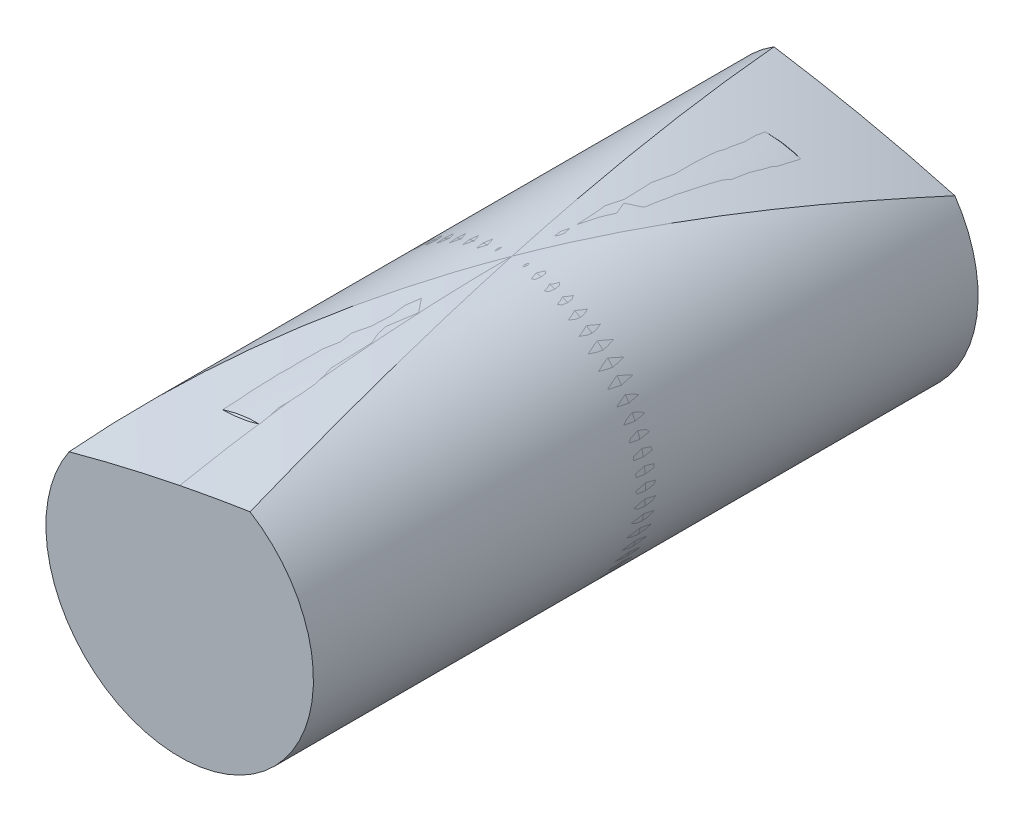
ISO-10303-21;
HEADER;
FILE_DESCRIPTION(('STEP AP214'),'2;1');
FILE_NAME('part.step','',(''),(''),'','','');
FILE_SCHEMA(('AUTOMOTIVE_DESIGN { 1 0 10303 214 1 1 1 1 }'));
ENDSEC;
DATA;
#1=APPLICATION_CONTEXT('core data for automotive mechanical design processes');
#2=APPLICATION_PROTOCOL_DEFINITION('international standard','automotive_design',2000,#1);
#3=PRODUCT_CONTEXT('',#1,'mechanical');
#4=PRODUCT('Part','Part','',(#3));
#5=PRODUCT_RELATED_PRODUCT_CATEGORY('part','',(#4));
#6=PRODUCT_DEFINITION_FORMATION('','',#4);
#7=PRODUCT_DEFINITION_CONTEXT('part definition',#1,'design');
#8=PRODUCT_DEFINITION('design','',#6,#7);
#9=PRODUCT_DEFINITION_SHAPE('','',#8);
#10=(LENGTH_UNIT() NAMED_UNIT(*) SI_UNIT(.MILLI.,.METRE.));
#11=(NAMED_UNIT(*) PLANE_ANGLE_UNIT() SI_UNIT($,.RADIAN.));
#12=(NAMED_UNIT(*) SI_UNIT($,.STERADIAN.) SOLID_ANGLE_UNIT());
#13=UNCERTAINTY_MEASURE_WITH_UNIT(LENGTH_MEASURE(1.E-05),#10,'distance_accuracy_value','');
#14=(GEOMETRIC_REPRESENTATION_CONTEXT(3) GLOBAL_UNCERTAINTY_ASSIGNED_CONTEXT((#13)) GLOBAL_UNIT_ASSIGNED_CONTEXT((#10,
#11,#12)) REPRESENTATION_CONTEXT('',''));
#15=CARTESIAN_POINT('',(0.,0.,0.));
#16=DIRECTION('',(0.,0.,1.));
#17=DIRECTION('',(1.,0.,0.));
#18=AXIS2_PLACEMENT_3D('',#15,#16,#17);
#19=CARTESIAN_POINT('',(0.,-101.5,0.));
#20=DIRECTION('',(-1.,0.,0.));
#21=DIRECTION('',(0.,0.,-1.));
#22=AXIS2_PLACEMENT_3D('',#19,#20,#21);
#23=ELLIPSE('',#22,169.705627484772,120.);
#24=TRIMMED_CURVE('',#23,(PARAMETER_VALUE(4.14971805766849)),
(PARAMETER_VALUE(5.27505990310089)),.T.,.PARAMETER.);
#25=CARTESIAN_POINT('',(0.,0.,-1045.96194077713));
#26=DIRECTION('',(0.,0.,-1.));
#27=AXIS1_PLACEMENT('',#25,#26);
#28=SURFACE_OF_REVOLUTION('',#24,#27);
#29=CARTESIAN_POINT('',(1.22166983066269E-13,0.,-34.990014612751));
#30=DIRECTION('',(0.,0.,1.));
#31=DIRECTION('',(1.,0.,0.));
#32=AXIS2_PLACEMENT_3D('',#29,#30,#31);
#33=CIRCLE('',#32,15.9216736326804);
#34=CARTESIAN_POINT('',(-15.9216736326803,0.,-34.990014612751));
#35=VERTEX_POINT('',#34);
#36=EDGE_CURVE('E51',#35,#35,#33,.T.);
#37=ORIENTED_EDGE('',*,*,#36,.T.);
#38=EDGE_LOOP('',(#37));
#39=FACE_BOUND('',#38,.T.);
#40=CARTESIAN_POINT('',(0.,0.,2.22044604925031E-13));
#41=DIRECTION('',(0.,0.,1.));
#42=DIRECTION('',(1.,0.,0.));
#43=AXIS2_PLACEMENT_3D('',#40,#41,#42);
#44=CIRCLE('',#43,18.5);
#45=CARTESIAN_POINT('',(18.5,0.,2.22044604925031E-13));
#46=VERTEX_POINT('',#45);
#47=EDGE_CURVE('E13',#46,#46,#44,.T.);
#48=ORIENTED_EDGE('',*,*,#47,.F.);
#49=EDGE_LOOP('',(#48));
#50=FACE_BOUND('',#49,.T.);
#51=ADVANCED_FACE('F45',(#39,#50),#28,.T.);
#52=CARTESIAN_POINT('',(0.,18.5,0.));
#53=DIRECTION('',(0.,0.,-1.));
#54=DIRECTION('',(1.,0.,0.));
#55=AXIS2_PLACEMENT_3D('',#52,#53,#54);
#56=PLANE('',#55);
#57=ORIENTED_EDGE('',*,*,#47,.T.);
#58=EDGE_LOOP('',(#57));
#59=FACE_BOUND('',#58,.T.);
#60=ADVANCED_FACE('F72',(#59),#56,.F.);
#61=CARTESIAN_POINT('',(1.22166983066269E-13,0.,-34.990014612751));
#62=DIRECTION('',(0.,0.,1.));
#63=DIRECTION('',(-1.,0.,0.));
#64=AXIS2_PLACEMENT_3D('',#61,#62,#63);
#65=CONICAL_SURFACE('',#64,15.9216736326804,0.785398163397456);
#66=CARTESIAN_POINT('',(1.60475258520348E-13,0.,-45.9619407771256));
#67=DIRECTION('',(0.,0.,1.));
#68=DIRECTION('',(1.,0.,0.));
#69=AXIS2_PLACEMENT_3D('',#66,#67,#68);
#70=CIRCLE('',#69,4.94974746830564);
#71=CARTESIAN_POINT('',(-4.94974746830547,0.,-45.9619407771256));
#72=VERTEX_POINT('',#71);
#73=EDGE_CURVE('E55',#72,#72,#70,.T.);
#74=CARTESIAN_POINT('',(-4.94974746830547,0.,-45.9619407771256));
#75=CARTESIAN_POINT('',(-5.06403836585105,0.,-45.84764987958));
#76=CARTESIAN_POINT('',(-5.17832926339662,0.,-45.7333589820345));
#77=CARTESIAN_POINT('',(-5.40691105848776,0.,-45.5047771869433));
#78=CARTESIAN_POINT('',(-5.52120195603333,0.,-45.3904862893977));
#79=CARTESIAN_POINT('',(-5.74978375112447,0.,-45.1619044943066));
#80=CARTESIAN_POINT('',(-5.86407464867004,0.,-45.047613596761));
#81=CARTESIAN_POINT('',(-6.09265644376118,0.,-44.8190318016699));
#82=CARTESIAN_POINT('',(-6.20694734130675,0.,-44.7047409041243));
#83=CARTESIAN_POINT('',(-6.43552913639789,0.,-44.4761591090332));
#84=CARTESIAN_POINT('',(-6.54982003394346,0.,-44.3618682114876));
#85=CARTESIAN_POINT('',(-6.77840182903461,0.,-44.1332864163965));
#86=CARTESIAN_POINT('',(-6.89269272658018,0.,-44.0189955188509));
#87=CARTESIAN_POINT('',(-7.12127452167132,0.,-43.7904137237598));
#88=CARTESIAN_POINT('',(-7.23556541921689,0.,-43.6761228262142));
#89=CARTESIAN_POINT('',(-7.46414721430803,0.,-43.4475410311231));
#90=CARTESIAN_POINT('',(-7.5784381118536,0.,-43.3332501335775));
#91=CARTESIAN_POINT('',(-7.80701990694474,0.,-43.1046683384864));
#92=CARTESIAN_POINT('',(-7.92131080449031,0.,-42.9903774409408));
#93=CARTESIAN_POINT('',(-8.14989259958146,0.,-42.7617956458497));
#94=CARTESIAN_POINT('',(-8.26418349712703,0.,-42.6475047483041));
#95=CARTESIAN_POINT('',(-8.49276529221817,0.,-42.418922953213));
#96=CARTESIAN_POINT('',(-8.60705618976374,0.,-42.3046320556674));
#97=CARTESIAN_POINT('',(-8.83563798485488,0.,-42.0760502605763));
#98=CARTESIAN_POINT('',(-8.94992888240045,0.,-41.9617593630307));
#99=CARTESIAN_POINT('',(-9.17851067749159,0.,-41.7331775679396));
#100=CARTESIAN_POINT('',(-9.29280157503716,0.,-41.618886670394));
#101=CARTESIAN_POINT('',(-9.52138337012831,0.,-41.3903048753029));
#102=CARTESIAN_POINT('',(-9.63567426767388,0.,-41.2760139777573));
#103=CARTESIAN_POINT('',(-9.86425606276502,0.,-41.0474321826662));
#104=CARTESIAN_POINT('',(-9.97854696031059,0.,-40.9331412851206));
#105=CARTESIAN_POINT('',(-10.2071287554017,0.,-40.7045594900294));
#106=CARTESIAN_POINT('',(-10.3214196529473,0.,-40.5902685924839));
#107=CARTESIAN_POINT('',(-10.5500014480384,0.,-40.3616867973927));
#108=CARTESIAN_POINT('',(-10.664292345584,0.,-40.2473958998472));
#109=CARTESIAN_POINT('',(-10.8928741406752,0.,-40.018814104756));
#110=CARTESIAN_POINT('',(-11.0071650382207,0.,-39.9045232072105));
#111=CARTESIAN_POINT('',(-11.2357468333119,0.,-39.6759414121193));
#112=CARTESIAN_POINT('',(-11.3500377308574,0.,-39.5616505145738));
#113=CARTESIAN_POINT('',(-11.5786195259486,0.,-39.3330687194826));
#114=CARTESIAN_POINT('',(-11.6929104234941,0.,-39.2187778219371));
#115=CARTESIAN_POINT('',(-11.9214922185853,0.,-38.9901960268459));
#116=CARTESIAN_POINT('',(-12.0357831161309,0.,-38.8759051293003));
#117=CARTESIAN_POINT('',(-12.264364911222,0.,-38.6473233342092));
#118=CARTESIAN_POINT('',(-12.3786558087676,0.,-38.5330324366636));
#119=CARTESIAN_POINT('',(-12.6072376038587,0.,-38.3044506415725));
#120=CARTESIAN_POINT('',(-12.7215285014043,0.,-38.1901597440269));
#121=CARTESIAN_POINT('',(-12.9501102964954,0.,-37.9615779489358));
#122=CARTESIAN_POINT('',(-13.064401194041,0.,-37.8472870513902));
#123=CARTESIAN_POINT('',(-13.2929829891321,0.,-37.6187052562991));
#124=CARTESIAN_POINT('',(-13.4072738866777,0.,-37.5044143587535));
#125=CARTESIAN_POINT('',(-13.6358556817689,0.,-37.2758325636624));
#126=CARTESIAN_POINT('',(-13.7501465793144,0.,-37.1615416661168));
#127=CARTESIAN_POINT('',(-13.9787283744056,0.,-36.9329598710257));
#128=CARTESIAN_POINT('',(-14.0930192719511,0.,-36.8186689734801));
#129=CARTESIAN_POINT('',(-14.3216010670423,0.,-36.590087178389));
#130=CARTESIAN_POINT('',(-14.4358919645878,0.,-36.4757962808434));
#131=CARTESIAN_POINT('',(-14.664473759679,0.,-36.2472144857523));
#132=CARTESIAN_POINT('',(-14.7787646572246,0.,-36.1329235882067));
#133=CARTESIAN_POINT('',(-15.0073464523157,0.,-35.9043417931156));
#134=CARTESIAN_POINT('',(-15.1216373498613,0.,-35.79005089557));
#135=CARTESIAN_POINT('',(-15.3502191449524,0.,-35.5614691004789));
#136=CARTESIAN_POINT('',(-15.464510042498,0.,-35.4471782029333));
#137=CARTESIAN_POINT('',(-15.6930918375891,0.,-35.2185964078422));
#138=CARTESIAN_POINT('',(-15.8073827351347,0.,-35.1043055102966));
#139=CARTESIAN_POINT('',(-15.9216736326803,0.,-34.990014612751));
#140=B_SPLINE_CURVE_WITH_KNOTS('',3,(#74,#75,#76,#77,#78,#79,#80,#81,#82,#83,#84,#85,#86,#87,
#88,#89,#90,#91,#92,#93,#94,#95,#96,#97,#98,#99,#100,#101,#102,#103,#104,#105,#106,#107,#108,
#109,#110,#111,#112,#113,#114,#115,#116,#117,#118,#119,#120,#121,#122,#123,#124,#125,#126,#127,
#128,#129,#130,#131,#132,#133,#134,#135,#136,#137,#138,#139),.UNSPECIFIED.,.F.,.F.,(4,2,2,2,2,2,
2,2,2,2,2,2,2,2,2,2,2,2,2,2,2,2,2,2,2,2,2,2,2,2,2,2,4),(0.,0.484895212094206,0.969790424188422,
1.45468563628264,1.93958084837685,2.42447606047107,2.90937127256528,3.3942664846595,
3.87916169675372,4.36405690884793,4.84895212094215,5.33384733303636,5.81874254513057,
6.30363775722478,6.788532969319,7.27342818141321,7.75832339350743,8.24321860560165,
8.72811381769586,9.21300902979008,9.6979042418843,10.1827994539785,10.6676946660727,
11.1525898781669,11.6374850902611,12.1223803023554,12.6072755144496,13.0921707265438,
13.577065938638,14.0619611507322,14.5468563628264,15.0317515749207,15.5166467870149),.UNSPECIFIED.);
#141=EDGE_CURVE('BSEAM64',#72,#35,#140,.T.);
#142=ORIENTED_EDGE('',*,*,#73,.T.);
#143=ORIENTED_EDGE('',*,*,#36,.F.);
#144=ORIENTED_EDGE('',*,*,#141,.T.);
#145=ORIENTED_EDGE('',*,*,#141,.F.);
#146=EDGE_LOOP('',(#142,#144,#143,#145));
#147=FACE_BOUND('',#146,.T.);
#148=ADVANCED_FACE('F64',(#147),#65,.T.);
#149=CARTESIAN_POINT('',(0.,14.0151505214792,-45.9619407771255));
#150=DIRECTION('',(0.,0.,1.));
#151=DIRECTION('',(-1.,0.,0.));
#152=AXIS2_PLACEMENT_3D('',#149,#150,#151);
#153=PLANE('',#152);
#154=ORIENTED_EDGE('',*,*,#73,.F.);
#155=EDGE_LOOP('',(#154));
#156=FACE_BOUND('',#155,.T.);
#157=ADVANCED_FACE('F67',(#156),#153,.F.);
#158=CLOSED_SHELL('',(#51,#60,#148,#157));
#159=MANIFOLD_SOLID_BREP('B2',#158);
#160=CARTESIAN_POINT('',(0.,-101.5,0.));
#161=DIRECTION('',(1.,0.,0.));
#162=DIRECTION('',(0.,0.,1.));
#163=AXIS2_PLACEMENT_3D('',#160,#161,#162);
#164=ELLIPSE('',#163,169.705627484772,120.);
#165=TRIMMED_CURVE('',#164,(PARAMETER_VALUE(4.14971805766849)),
(PARAMETER_VALUE(5.27505990310089)),.T.,.PARAMETER.);
#166=CARTESIAN_POINT('',(0.,0.,1045.96194077713));
#167=DIRECTION('',(0.,0.,1.));
#168=AXIS1_PLACEMENT('',#166,#167);
#169=SURFACE_OF_REVOLUTION('',#165,#168);
#170=CARTESIAN_POINT('',(1.22166983066269E-13,0.,34.990014612751));
#171=DIRECTION('',(0.,0.,1.));
#172=DIRECTION('',(1.,0.,0.));
#173=AXIS2_PLACEMENT_3D('',#170,#171,#172);
#174=CIRCLE('',#173,15.9216736326804);
#175=CARTESIAN_POINT('',(-15.9216736326803,0.,34.990014612751));
#176=VERTEX_POINT('',#175);
#177=EDGE_CURVE('E117',#176,#176,#174,.T.);
#178=ORIENTED_EDGE('',*,*,#177,.F.);
#179=EDGE_LOOP('',(#178));
#180=FACE_BOUND('',#179,.T.);
#181=CARTESIAN_POINT('',(0.,0.,-2.22044604925031E-13));
#182=DIRECTION('',(0.,0.,1.));
#183=DIRECTION('',(1.,0.,0.));
#184=AXIS2_PLACEMENT_3D('',#181,#182,#183);
#185=CIRCLE('',#184,18.5);
#186=CARTESIAN_POINT('',(18.5,0.,-2.22044604925031E-13));
#187=VERTEX_POINT('',#186);
#188=EDGE_CURVE('E44',#187,#187,#185,.T.);
#189=ORIENTED_EDGE('',*,*,#188,.T.);
#190=EDGE_LOOP('',(#189));
#191=FACE_BOUND('',#190,.T.);
#192=ADVANCED_FACE('F111',(#180,#191),#169,.T.);
#193=CARTESIAN_POINT('',(0.,18.5,0.));
#194=DIRECTION('',(0.,0.,1.));
#195=DIRECTION('',(1.,0.,0.));
#196=AXIS2_PLACEMENT_3D('',#193,#194,#195);
#197=PLANE('',#196);
#198=ORIENTED_EDGE('',*,*,#188,.F.);
#199=EDGE_LOOP('',(#198));
#200=FACE_BOUND('',#199,.T.);
#201=ADVANCED_FACE('F134',(#200),#197,.F.);
#202=CARTESIAN_POINT('',(1.22166983066269E-13,0.,34.990014612751));
#203=DIRECTION('',(0.,0.,-1.));
#204=DIRECTION('',(-1.,0.,0.));
#205=AXIS2_PLACEMENT_3D('',#202,#203,#204);
#206=CONICAL_SURFACE('',#205,15.9216736326804,0.785398163397456);
#207=CARTESIAN_POINT('',(1.60475258520348E-13,0.,45.9619407771256));
#208=DIRECTION('',(0.,0.,1.));
#209=DIRECTION('',(1.,0.,0.));
#210=AXIS2_PLACEMENT_3D('',#207,#208,#209);
#211=CIRCLE('',#210,4.94974746830564);
#212=CARTESIAN_POINT('',(-4.94974746830547,0.,45.9619407771256));
#213=VERTEX_POINT('',#212);
#214=EDGE_CURVE('E121',#213,#213,#211,.T.);
#215=CARTESIAN_POINT('',(-4.94974746830547,0.,45.9619407771256));
#216=CARTESIAN_POINT('',(-5.06403836585105,0.,45.84764987958));
#217=CARTESIAN_POINT('',(-5.17832926339662,0.,45.7333589820345));
#218=CARTESIAN_POINT('',(-5.40691105848776,0.,45.5047771869433));
#219=CARTESIAN_POINT('',(-5.52120195603333,0.,45.3904862893977));
#220=CARTESIAN_POINT('',(-5.74978375112447,0.,45.1619044943066));
#221=CARTESIAN_POINT('',(-5.86407464867004,0.,45.047613596761));
#222=CARTESIAN_POINT('',(-6.09265644376118,0.,44.8190318016699));
#223=CARTESIAN_POINT('',(-6.20694734130675,0.,44.7047409041243));
#224=CARTESIAN_POINT('',(-6.43552913639789,0.,44.4761591090332));
#225=CARTESIAN_POINT('',(-6.54982003394346,0.,44.3618682114876));
#226=CARTESIAN_POINT('',(-6.77840182903461,0.,44.1332864163965));
#227=CARTESIAN_POINT('',(-6.89269272658018,0.,44.0189955188509));
#228=CARTESIAN_POINT('',(-7.12127452167132,0.,43.7904137237598));
#229=CARTESIAN_POINT('',(-7.23556541921689,0.,43.6761228262142));
#230=CARTESIAN_POINT('',(-7.46414721430803,0.,43.4475410311231));
#231=CARTESIAN_POINT('',(-7.5784381118536,0.,43.3332501335775));
#232=CARTESIAN_POINT('',(-7.80701990694474,0.,43.1046683384864));
#233=CARTESIAN_POINT('',(-7.92131080449031,0.,42.9903774409408));
#234=CARTESIAN_POINT('',(-8.14989259958146,0.,42.7617956458497));
#235=CARTESIAN_POINT('',(-8.26418349712703,0.,42.6475047483041));
#236=CARTESIAN_POINT('',(-8.49276529221817,0.,42.418922953213));
#237=CARTESIAN_POINT('',(-8.60705618976374,0.,42.3046320556674));
#238=CARTESIAN_POINT('',(-8.83563798485488,0.,42.0760502605763));
#239=CARTESIAN_POINT('',(-8.94992888240045,0.,41.9617593630307));
#240=CARTESIAN_POINT('',(-9.17851067749159,0.,41.7331775679396));
#241=CARTESIAN_POINT('',(-9.29280157503716,0.,41.618886670394));
#242=CARTESIAN_POINT('',(-9.52138337012831,0.,41.3903048753029));
#243=CARTESIAN_POINT('',(-9.63567426767388,0.,41.2760139777573));
#244=CARTESIAN_POINT('',(-9.86425606276502,0.,41.0474321826662));
#245=CARTESIAN_POINT('',(-9.97854696031059,0.,40.9331412851206));
#246=CARTESIAN_POINT('',(-10.2071287554017,0.,40.7045594900294));
#247=CARTESIAN_POINT('',(-10.3214196529473,0.,40.5902685924839));
#248=CARTESIAN_POINT('',(-10.5500014480384,0.,40.3616867973927));
#249=CARTESIAN_POINT('',(-10.664292345584,0.,40.2473958998472));
#250=CARTESIAN_POINT('',(-10.8928741406752,0.,40.018814104756));
#251=CARTESIAN_POINT('',(-11.0071650382207,0.,39.9045232072105));
#252=CARTESIAN_POINT('',(-11.2357468333119,0.,39.6759414121193));
#253=CARTESIAN_POINT('',(-11.3500377308574,0.,39.5616505145738));
#254=CARTESIAN_POINT('',(-11.5786195259486,0.,39.3330687194826));
#255=CARTESIAN_POINT('',(-11.6929104234941,0.,39.2187778219371));
#256=CARTESIAN_POINT('',(-11.9214922185853,0.,38.9901960268459));
#257=CARTESIAN_POINT('',(-12.0357831161309,0.,38.8759051293003));
#258=CARTESIAN_POINT('',(-12.264364911222,0.,38.6473233342092));
#259=CARTESIAN_POINT('',(-12.3786558087676,0.,38.5330324366636));
#260=CARTESIAN_POINT('',(-12.6072376038587,0.,38.3044506415725));
#261=CARTESIAN_POINT('',(-12.7215285014043,0.,38.1901597440269));
#262=CARTESIAN_POINT('',(-12.9501102964954,0.,37.9615779489358));
#263=CARTESIAN_POINT('',(-13.064401194041,0.,37.8472870513902));
#264=CARTESIAN_POINT('',(-13.2929829891321,0.,37.6187052562991));
#265=CARTESIAN_POINT('',(-13.4072738866777,0.,37.5044143587535));
#266=CARTESIAN_POINT('',(-13.6358556817689,0.,37.2758325636624));
#267=CARTESIAN_POINT('',(-13.7501465793144,0.,37.1615416661168));
#268=CARTESIAN_POINT('',(-13.9787283744056,0.,36.9329598710257));
#269=CARTESIAN_POINT('',(-14.0930192719511,0.,36.8186689734801));
#270=CARTESIAN_POINT('',(-14.3216010670423,0.,36.590087178389));
#271=CARTESIAN_POINT('',(-14.4358919645878,0.,36.4757962808434));
#272=CARTESIAN_POINT('',(-14.664473759679,0.,36.2472144857523));
#273=CARTESIAN_POINT('',(-14.7787646572246,0.,36.1329235882067));
#274=CARTESIAN_POINT('',(-15.0073464523157,0.,35.9043417931156));
#275=CARTESIAN_POINT('',(-15.1216373498613,0.,35.79005089557));
#276=CARTESIAN_POINT('',(-15.3502191449524,0.,35.5614691004789));
#277=CARTESIAN_POINT('',(-15.464510042498,0.,35.4471782029333));
#278=CARTESIAN_POINT('',(-15.6930918375891,0.,35.2185964078422));
#279=CARTESIAN_POINT('',(-15.8073827351347,0.,35.1043055102966));
#280=CARTESIAN_POINT('',(-15.9216736326803,0.,34.990014612751));
#281=B_SPLINE_CURVE_WITH_KNOTS('',3,(#215,#216,#217,#218,#219,#220,#221,#222,#223,#224,#225,
#226,#227,#228,#229,#230,#231,#232,#233,#234,#235,#236,#237,#238,#239,#240,#241,#242,#243,#244,
#245,#246,#247,#248,#249,#250,#251,#252,#253,#254,#255,#256,#257,#258,#259,#260,#261,#262,#263,
#264,#265,#266,#267,#268,#269,#270,#271,#272,#273,#274,#275,#276,#277,#278,#279,#280),
.UNSPECIFIED.,.F.,.F.,(4,2,2,2,2,2,2,2,2,2,2,2,2,2,2,2,2,2,2,2,2,2,2,2,2,2,2,2,2,2,2,2,4),(0.,
0.484895212094206,0.969790424188422,1.45468563628264,1.93958084837685,2.42447606047107,
2.90937127256528,3.3942664846595,3.87916169675372,4.36405690884793,4.84895212094215,
5.33384733303636,5.81874254513057,6.30363775722478,6.788532969319,7.27342818141321,
7.75832339350743,8.24321860560165,8.72811381769586,9.21300902979008,9.6979042418843,
10.1827994539785,10.6676946660727,11.1525898781669,11.6374850902611,12.1223803023554,
12.6072755144496,13.0921707265438,13.577065938638,14.0619611507322,14.5468563628264,
15.0317515749207,15.5166467870149),.UNSPECIFIED.);
#282=EDGE_CURVE('BSEAM132',#213,#176,#281,.T.);
#283=ORIENTED_EDGE('',*,*,#214,.F.);
#284=ORIENTED_EDGE('',*,*,#177,.T.);
#285=ORIENTED_EDGE('',*,*,#282,.T.);
#286=ORIENTED_EDGE('',*,*,#282,.F.);
#287=EDGE_LOOP('',(#283,#285,#284,#286));
#288=FACE_BOUND('',#287,.T.);
#289=ADVANCED_FACE('F132',(#288),#206,.T.);
#290=CARTESIAN_POINT('',(0.,14.0151505214792,45.9619407771255));
#291=DIRECTION('',(0.,0.,-1.));
#292=DIRECTION('',(-1.,0.,0.));
#293=AXIS2_PLACEMENT_3D('',#290,#291,#292);
#294=PLANE('',#293);
#295=ORIENTED_EDGE('',*,*,#214,.T.);
#296=EDGE_LOOP('',(#295));
#297=FACE_BOUND('',#296,.T.);
#298=ADVANCED_FACE('F130',(#297),#294,.F.);
#299=CLOSED_SHELL('',(#192,#201,#289,#298));
#300=MANIFOLD_SOLID_BREP('B8',#299);
#301=CARTESIAN_POINT('',(-32.230970388563,-101.5,-32.2309703885631));
#302=DIRECTION('',(0.707106781186546,0.,0.707106781186549));
#303=DIRECTION('',(0.707106781186549,0.,-0.707106781186546));
#304=AXIS2_PLACEMENT_3D('',#301,#302,#303);
#305=CYLINDRICAL_SURFACE('',#304,120.);
#306=CARTESIAN_POINT('',(45.9619407771253,-101.5,45.9619407771255));
#307=DIRECTION('',(0.,0.,1.));
#308=DIRECTION('',(1.,0.,0.));
#309=AXIS2_PLACEMENT_3D('',#306,#307,#308);
#310=ELLIPSE('',#309,169.705627484771,120.);
#311=CARTESIAN_POINT('',(0.,14.0151505214792,45.9619407771255));
#312=VERTEX_POINT('',#311);
#313=CARTESIAN_POINT('',(-15.2929889127589,10.4103069173888,45.9619407771255));
#314=VERTEX_POINT('',#313);
#315=EDGE_CURVE('E222',#312,#314,#310,.T.);
#316=ORIENTED_EDGE('',*,*,#315,.F.);
#317=CARTESIAN_POINT('',(0.,-101.5,0.));
#318=DIRECTION('',(-1.,0.,0.));
#319=DIRECTION('',(0.,0.,1.));
#320=AXIS2_PLACEMENT_3D('',#317,#318,#319);
#321=ELLIPSE('',#320,169.705627484772,120.);
#322=CARTESIAN_POINT('',(0.,18.5,0.));
#323=VERTEX_POINT('',#322);
#324=EDGE_CURVE('E109',#312,#323,#321,.T.);
#325=ORIENTED_EDGE('',*,*,#324,.T.);
#326=CARTESIAN_POINT('',(-15.2929889127589,10.4103069173888,45.9619407771255));
#327=CARTESIAN_POINT('',(-15.1271700444119,10.6539013564125,45.2376941706608));
#328=CARTESIAN_POINT('',(-14.9559293155512,10.8929432573147,44.5131782309109));
#329=CARTESIAN_POINT('',(-14.6031019936619,11.3615769141494,43.0636188158964));
#330=CARTESIAN_POINT('',(-14.4215155215807,11.5911687805041,42.3385753468968));
#331=CARTESIAN_POINT('',(-13.8620103905314,12.2652213981579,40.1627699443657));
#332=CARTESIAN_POINT('',(-13.4693172672671,12.6950012687146,38.7112081924549));
#333=CARTESIAN_POINT('',(-12.6486415577219,13.5128644745425,35.8063563470584));
#334=CARTESIAN_POINT('',(-12.2206587732178,13.9009475755733,34.3530662439097));
#335=CARTESIAN_POINT('',(-11.3334993938097,14.6332710586612,31.444950732525));
#336=CARTESIAN_POINT('',(-10.8743226262806,14.9775111980643,29.9901253158365));
#337=CARTESIAN_POINT('',(-9.93043756388062,15.6192526305988,27.0838914351318));
#338=CARTESIAN_POINT('',(-9.44581664705003,15.9169014872415,25.6324871377557));
#339=CARTESIAN_POINT('',(-8.45378650334115,16.465257289787,22.7285968417904));
#340=CARTESIAN_POINT('',(-7.94637719465863,16.7159640671635,21.2761108393366));
#341=CARTESIAN_POINT('',(-6.91303547603099,17.1691042536039,18.370703781801));
#342=CARTESIAN_POINT('',(-6.38710857865191,17.371551891961,16.9177829817434));
#343=CARTESIAN_POINT('',(-5.32072724122333,17.7272597748298,14.0113577069651));
#344=CARTESIAN_POINT('',(-4.78027391314878,17.8805237727147,12.5578532852628));
#345=CARTESIAN_POINT('',(-3.89005440682382,18.0898534973487,10.1862167870685));
#346=CARTESIAN_POINT('',(-3.54342070089905,18.1609238649461,9.26820383639262));
#347=CARTESIAN_POINT('',(-2.84704408675393,18.2830325586007,7.43209716045552));
#348=CARTESIAN_POINT('',(-2.49730142632781,18.3340724667704,6.51400344730506));
#349=CARTESIAN_POINT('',(-1.79581019826652,18.4160185890243,4.67796411892536));
#350=CARTESIAN_POINT('',(-1.44406217361119,18.4469300142083,3.76001852692372));
#351=CARTESIAN_POINT('',(-0.739503962411319,18.4885818805788,1.92408739283983));
#352=CARTESIAN_POINT('',(-0.386693803271423,18.4993228378008,1.0061018523805));
#353=CARTESIAN_POINT('',(-0.0225848858854962,18.4999896626221,0.0587613864412983));
#354=CARTESIAN_POINT('',(-0.0112924375015752,18.5000000021406,0.0293806790583003));
#355=CARTESIAN_POINT('',(0.,18.5,0.));
#356=B_SPLINE_CURVE_WITH_KNOTS('',3,(#326,#327,#328,#329,#330,#331,#332,#333,#334,#335,#336,
#337,#338,#339,#340,#341,#342,#343,#344,#345,#346,#347,#348,#349,#350,#351,#352,#353,#354,#355),
.UNSPECIFIED.,.F.,.F.,(4,2,2,2,2,2,2,2,2,2,2,2,2,2,4),(0.,2.34563083123029,4.69123424634591,
9.38203681352101,14.0728657309029,18.7637206090863,23.4394041659584,28.1151045086227,
32.78942450273,37.4633876984981,40.4147408083962,43.3658607577581,46.3162163821921,
49.2664965245458,49.3609248447965),.UNSPECIFIED.);
#357=EDGE_CURVE('E213',#323,#314,#356,.F.);
#358=ORIENTED_EDGE('',*,*,#357,.T.);
#359=EDGE_LOOP('',(#316,#325,#358));
#360=FACE_BOUND('',#359,.T.);
#361=ADVANCED_FACE('F168',(#360),#305,.T.);
#362=CARTESIAN_POINT('',(0.,0.,45.9619407771255));
#363=DIRECTION('',(0.,0.,-1.));
#364=DIRECTION('',(-1.,0.,0.));
#365=AXIS2_PLACEMENT_3D('',#362,#363,#364);
#366=CYLINDRICAL_SURFACE('',#365,18.5);
#367=CARTESIAN_POINT('',(9.73178878921661,15.7334766330293,45.9619407771255));
#368=CARTESIAN_POINT('',(9.43122663698604,15.9193640139238,44.4583061778544));
#369=CARTESIAN_POINT('',(9.12770923211374,16.0952173786776,42.9540329236591));
#370=CARTESIAN_POINT('',(8.51549998717453,16.427346610667,39.9443960390859));
#371=CARTESIAN_POINT('',(8.20680820931715,16.5836227130816,38.439032422025));
#372=CARTESIAN_POINT('',(7.58498141509777,16.8770912730082,35.4273771527896));
#373=CARTESIAN_POINT('',(7.27184643281925,17.0142838768211,33.9210855078185));
#374=CARTESIAN_POINT('',(6.64178420888544,17.2699819366176,30.907713745592));
#375=CARTESIAN_POINT('',(6.32485695573023,17.3884873359175,29.4006336259588));
#376=CARTESIAN_POINT('',(5.36959840590565,17.7163999903673,24.8797606445063));
#377=CARTESIAN_POINT('',(4.72650190754578,17.8983385951163,21.8649436730013));
#378=CARTESIAN_POINT('',(3.43209556545155,18.1909574263122,15.8337461540345));
#379=CARTESIAN_POINT('',(2.78078600210085,18.3016400786686,12.8173656633023));
#380=CARTESIAN_POINT('',(1.77696888580999,18.4178375385153,8.18269092881018));
#381=CARTESIAN_POINT('',(1.42594614157625,18.4483199162275,6.56466194247508));
#382=CARTESIAN_POINT('',(0.723300020603625,18.489204918748,3.32850778093011));
#383=CARTESIAN_POINT('',(0.371676659762973,18.499608067053,1.7103826093279));
#384=CARTESIAN_POINT('',(0.01336791557602,18.499996376633,0.0615164920276822));
#385=CARTESIAN_POINT('',(0.00668395700336975,18.4999999989162,0.0307582425894583));
#386=CARTESIAN_POINT('',(0.,18.5,0.));
#387=B_SPLINE_CURVE_WITH_KNOTS('',3,(#367,#368,#369,#370,#371,#372,#373,#374,#375,#376,#377,
#378,#379,#380,#381,#382,#383,#384,#385,#386),.UNSPECIFIED.,.F.,.F.,(4,2,2,2,2,2,2,2,2,4),(0.,
4.63376718739126,9.26747870464097,13.9011546962548,18.534844742883,27.7979436380363,
37.0607271542549,42.0284725756185,46.9960884784464,47.0905167942273),.UNSPECIFIED.);
#388=CARTESIAN_POINT('',(9.73178878921661,15.7334766330293,45.9619407771255));
#389=VERTEX_POINT('',#388);
#390=EDGE_CURVE('E214',#389,#323,#387,.T.);
#391=ORIENTED_EDGE('',*,*,#390,.F.);
#392=CARTESIAN_POINT('',(0.,0.,45.9619407771255));
#393=DIRECTION('',(0.,0.,1.));
#394=DIRECTION('',(1.,0.,0.));
#395=AXIS2_PLACEMENT_3D('',#392,#393,#394);
#396=CIRCLE('',#395,18.5);
#397=EDGE_CURVE('E207',#314,#389,#396,.T.);
#398=ORIENTED_EDGE('',*,*,#397,.F.);
#399=ORIENTED_EDGE('',*,*,#357,.F.);
#400=CARTESIAN_POINT('',(-9.73178878921988,15.7334766330272,-45.9619407771259));
#401=CARTESIAN_POINT('',(-9.43122663698735,15.919364013923,-44.4583061778552));
#402=CARTESIAN_POINT('',(-9.1277092321142,16.0952173786773,-42.9540329236598));
#403=CARTESIAN_POINT('',(-8.51549998717429,16.4273466106672,-39.9443960390863));
#404=CARTESIAN_POINT('',(-8.20680820931706,16.5836227130817,-38.4390324220252));
#405=CARTESIAN_POINT('',(-7.58498141509776,16.8770912730082,-35.4273771527893));
#406=CARTESIAN_POINT('',(-7.27184643281916,17.0142838768211,-33.921085507818));
#407=CARTESIAN_POINT('',(-6.64178420888515,17.2699819366177,-30.9077137455911));
#408=CARTESIAN_POINT('',(-6.32485695572981,17.3884873359176,-29.4006336259577));
#409=CARTESIAN_POINT('',(-5.36959840590582,17.7163999903674,-24.8797606445054));
#410=CARTESIAN_POINT('',(-4.72650190754748,17.8983385951162,-21.8649436730005));
#411=CARTESIAN_POINT('',(-3.43209556545001,18.1909574263122,-15.8337461540353));
#412=CARTESIAN_POINT('',(-2.78078600209453,18.3016400786686,-12.8173656633045));
#413=CARTESIAN_POINT('',(-1.7769688858137,18.4178375385153,-8.18269092881047));
#414=CARTESIAN_POINT('',(-1.42594614158667,18.4483199162274,-6.5646619424737));
#415=CARTESIAN_POINT('',(-0.723300020593502,18.4892049187481,-3.32850778093274));
#416=CARTESIAN_POINT('',(-0.371676659725606,18.499608067053,-1.71038260933623));
#417=CARTESIAN_POINT('',(-0.0133679155746104,18.499996376633,-0.0615164920279768));
#418=CARTESIAN_POINT('',(-0.00668395700265448,18.4999999989162,-0.0307582425896023));
#419=CARTESIAN_POINT('',(0.,18.5,0.));
#420=B_SPLINE_CURVE_WITH_KNOTS('',3,(#400,#401,#402,#403,#404,#405,#406,#407,#408,#409,#410,
#411,#412,#413,#414,#415,#416,#417,#418,#419),.UNSPECIFIED.,.F.,.F.,(4,2,2,2,2,2,2,2,2,4),(0.,
4.63376718739199,9.26747870464241,13.9011546962568,18.5348447428856,27.7979436380377,
37.0607271542549,42.0284725756191,46.9960884784478,47.0905167942286),.UNSPECIFIED.);
#421=CARTESIAN_POINT('',(-9.73178878921945,15.7334766330275,-45.9619407771259));
#422=VERTEX_POINT('',#421);
#423=EDGE_CURVE('E202',#422,#323,#420,.T.);
#424=ORIENTED_EDGE('',*,*,#423,.F.);
#425=CARTESIAN_POINT('',(0.,0.,-45.9619407771259));
#426=DIRECTION('',(0.,0.,1.));
#427=DIRECTION('',(1.,0.,0.));
#428=AXIS2_PLACEMENT_3D('',#425,#426,#427);
#429=CIRCLE('',#428,18.5);
#430=CARTESIAN_POINT('',(15.2929889127608,10.4103069173859,-45.9619407771259));
#431=VERTEX_POINT('',#430);
#432=EDGE_CURVE('E210',#422,#431,#429,.T.);
#433=ORIENTED_EDGE('',*,*,#432,.T.);
#434=CARTESIAN_POINT('',(15.2929889127611,10.4103069173855,-45.9619407771259));
#435=CARTESIAN_POINT('',(15.1271700444129,10.6539013564112,-45.2376941706614));
#436=CARTESIAN_POINT('',(14.9559293155515,10.8929432573143,-44.5131782309112));
#437=CARTESIAN_POINT('',(14.6031019936615,11.3615769141499,-43.0636188158958));
#438=CARTESIAN_POINT('',(14.4215155215803,11.5911687805047,-42.3385753468955));
#439=CARTESIAN_POINT('',(13.8620103905307,12.2652213981587,-40.1627699443622));
#440=CARTESIAN_POINT('',(13.4693172672659,12.6950012687159,-38.7112081924503));
#441=CARTESIAN_POINT('',(12.6486415577199,13.5128644745445,-35.8063563470515));
#442=CARTESIAN_POINT('',(12.2206587732154,13.9009475755755,-34.3530662439017));
#443=CARTESIAN_POINT('',(11.3334993938065,14.6332710586636,-31.4449507325148));
#444=CARTESIAN_POINT('',(10.874322626277,14.9775111980669,-29.9901253158253));
#445=CARTESIAN_POINT('',(9.93043756387691,15.6192526306011,-27.0838914351206));
#446=CARTESIAN_POINT('',(9.44581664704667,15.9169014872435,-25.6324871377457));
#447=CARTESIAN_POINT('',(8.4537865033385,16.4652572897883,-22.7285968417828));
#448=CARTESIAN_POINT('',(7.94637719465634,16.7159640671645,-21.2761108393302));
#449=CARTESIAN_POINT('',(6.91303547602952,17.1691042536045,-18.3707037817969));
#450=CARTESIAN_POINT('',(6.3871085786509,17.3715518919613,-16.9177829817404));
#451=CARTESIAN_POINT('',(5.32072724122309,17.7272597748299,-14.0113577069644));
#452=CARTESIAN_POINT('',(4.78027391314885,17.8805237727146,-12.5578532852632));
#453=CARTESIAN_POINT('',(3.89005440682447,18.0898534973486,-10.1862167870699));
#454=CARTESIAN_POINT('',(3.54342070089981,18.160923864946,-9.26820383639382));
#455=CARTESIAN_POINT('',(2.84704408675408,18.2830325586006,-7.43209716045668));
#456=CARTESIAN_POINT('',(2.49730142632723,18.3340724667703,-6.51400344730638));
#457=CARTESIAN_POINT('',(1.79581019826807,18.4160185890242,-4.67796411892557));
#458=CARTESIAN_POINT('',(1.44406217361559,18.4469300142082,-3.76001852692267));
#459=CARTESIAN_POINT('',(0.739503962407355,18.4885818805788,-1.92408739284166));
#460=CARTESIAN_POINT('',(0.38669380325625,18.4993228378008,-1.00610185238647));
#461=CARTESIAN_POINT('',(0.0225848858845291,18.4999896626221,-0.0587613864416495));
#462=CARTESIAN_POINT('',(0.0112924375010772,18.5000000021406,-0.0293806790584751));
#463=CARTESIAN_POINT('',(0.,18.5,0.));
#464=B_SPLINE_CURVE_WITH_KNOTS('',3,(#434,#435,#436,#437,#438,#439,#440,#441,#442,#443,#444,
#445,#446,#447,#448,#449,#450,#451,#452,#453,#454,#455,#456,#457,#458,#459,#460,#461,#462,#463),
.UNSPECIFIED.,.F.,.F.,(4,2,2,2,2,2,2,2,2,2,2,2,2,2,4),(0.,2.34563083123235,4.69123424635002,
9.38203681352922,14.0728657309146,18.7637206091015,23.4394041659697,28.1151045086302,
32.7894245027339,37.4633876984983,40.4147408083968,43.3658607577591,46.3162163821936,
49.2664965245478,49.3609248447984),.UNSPECIFIED.);
#465=EDGE_CURVE('E190',#323,#431,#464,.F.);
#466=ORIENTED_EDGE('',*,*,#465,.F.);
#467=EDGE_LOOP('',(#391,#398,#399,#424,#433,#466));
#468=FACE_BOUND('',#467,.T.);
#469=ADVANCED_FACE('F170',(#468),#366,.T.);
#470=CARTESIAN_POINT('',(0.,0.,45.9619407771255));
#471=DIRECTION('',(0.,0.,1.));
#472=DIRECTION('',(1.,0.,0.));
#473=AXIS2_PLACEMENT_3D('',#470,#471,#472);
#474=PLANE('',#473);
#475=ORIENTED_EDGE('',*,*,#397,.T.);
#476=EDGE_CURVE('E217',#389,#312,#310,.T.);
#477=ORIENTED_EDGE('',*,*,#476,.T.);
#478=ORIENTED_EDGE('',*,*,#315,.T.);
#479=EDGE_LOOP('',(#475,#477,#478));
#480=FACE_BOUND('',#479,.T.);
#481=ADVANCED_FACE('F253',(#480),#474,.T.);
#482=CARTESIAN_POINT('',(0.,0.,-45.9619407771259));
#483=DIRECTION('',(0.,0.,1.));
#484=DIRECTION('',(1.,0.,0.));
#485=AXIS2_PLACEMENT_3D('',#482,#483,#484);
#486=PLANE('',#485);
#487=CARTESIAN_POINT('',(-45.9619407771258,-101.5,-45.9619407771259));
#488=DIRECTION('',(0.,0.,1.));
#489=DIRECTION('',(1.,0.,0.));
#490=AXIS2_PLACEMENT_3D('',#487,#488,#489);
#491=ELLIPSE('',#490,169.705627484771,120.);
#492=EDGE_CURVE('E177',#431,#422,#491,.T.);
#493=ORIENTED_EDGE('',*,*,#492,.F.);
#494=ORIENTED_EDGE('',*,*,#432,.F.);
#495=EDGE_LOOP('',(#493,#494));
#496=FACE_BOUND('',#495,.T.);
#497=ADVANCED_FACE('F216',(#496),#486,.F.);
#498=ORIENTED_EDGE('',*,*,#423,.T.);
#499=ORIENTED_EDGE('',*,*,#465,.T.);
#500=ORIENTED_EDGE('',*,*,#492,.T.);
#501=EDGE_LOOP('',(#498,#499,#500));
#502=FACE_BOUND('',#501,.T.);
#503=ADVANCED_FACE('F201',(#502),#305,.T.);
#504=ORIENTED_EDGE('',*,*,#324,.F.);
#505=ORIENTED_EDGE('',*,*,#476,.F.);
#506=ORIENTED_EDGE('',*,*,#390,.T.);
#507=EDGE_LOOP('',(#504,#505,#506));
#508=FACE_BOUND('',#507,.T.);
#509=ADVANCED_FACE('F235',(#508),#305,.T.);
#510=CLOSED_SHELL('',(#361,#469,#481,#497,#503,#509));
#511=MANIFOLD_SOLID_BREP('B39',#510);
#512=ADVANCED_BREP_SHAPE_REPRESENTATION('',(#18,#159,#300,#511),#14);
#513=SHAPE_DEFINITION_REPRESENTATION(#9,#512);
ENDSEC;
END-ISO-10303-21;
